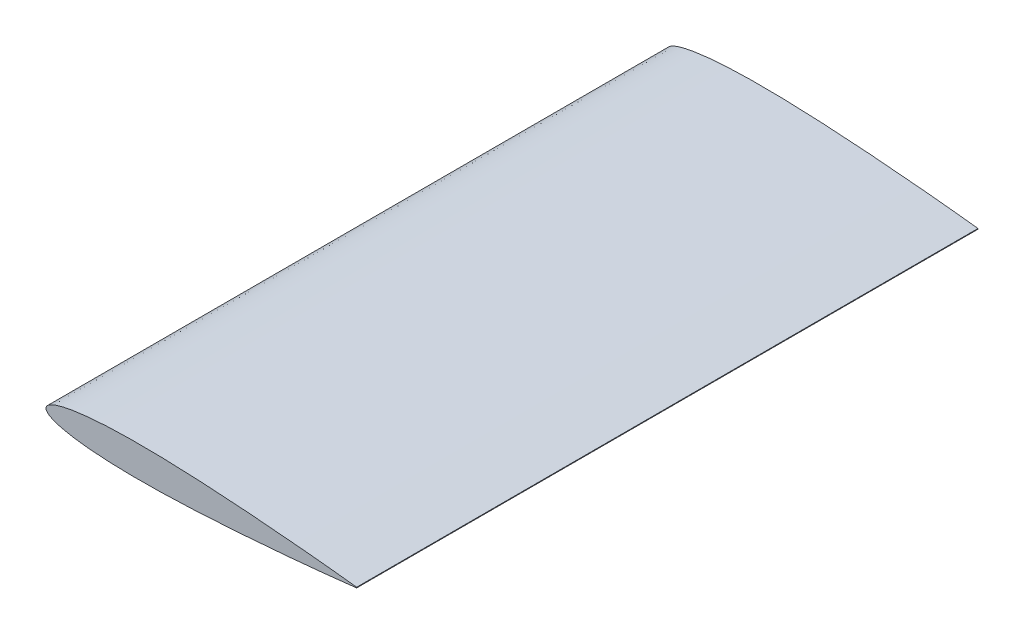
ISO-10303-21;
HEADER;
FILE_DESCRIPTION(('STEP AP214'),'2;1');
FILE_NAME('part.step','',(''),(''),'','','');
FILE_SCHEMA(('AUTOMOTIVE_DESIGN { 1 0 10303 214 1 1 1 1 }'));
ENDSEC;
DATA;
#1=APPLICATION_CONTEXT('core data for automotive mechanical design processes');
#2=APPLICATION_PROTOCOL_DEFINITION('international standard','automotive_design',2000,#1);
#3=PRODUCT_CONTEXT('',#1,'mechanical');
#4=PRODUCT('Part','Part','',(#3));
#5=PRODUCT_RELATED_PRODUCT_CATEGORY('part','',(#4));
#6=PRODUCT_DEFINITION_FORMATION('','',#4);
#7=PRODUCT_DEFINITION_CONTEXT('part definition',#1,'design');
#8=PRODUCT_DEFINITION('design','',#6,#7);
#9=PRODUCT_DEFINITION_SHAPE('','',#8);
#10=(LENGTH_UNIT() NAMED_UNIT(*) SI_UNIT(.MILLI.,.METRE.));
#11=(NAMED_UNIT(*) PLANE_ANGLE_UNIT() SI_UNIT($,.RADIAN.));
#12=(NAMED_UNIT(*) SI_UNIT($,.STERADIAN.) SOLID_ANGLE_UNIT());
#13=UNCERTAINTY_MEASURE_WITH_UNIT(LENGTH_MEASURE(1.E-05),#10,'distance_accuracy_value','');
#14=(GEOMETRIC_REPRESENTATION_CONTEXT(3) GLOBAL_UNCERTAINTY_ASSIGNED_CONTEXT((#13)) GLOBAL_UNIT_ASSIGNED_CONTEXT((#10,
#11,#12)) REPRESENTATION_CONTEXT('',''));
#15=CARTESIAN_POINT('',(0.,0.,0.));
#16=DIRECTION('',(0.,0.,1.));
#17=DIRECTION('',(1.,0.,0.));
#18=AXIS2_PLACEMENT_3D('',#15,#16,#17);
#19=CARTESIAN_POINT('',(40.1321242567515,0.0535132591243339,76.2));
#20=CARTESIAN_POINT('',(40.1279418105788,0.0540050721144117,76.2));
#21=CARTESIAN_POINT('',(40.1112306810011,0.0559701304238156,76.2));
#22=CARTESIAN_POINT('',(40.0736500018208,0.0603077694182548,76.2));
#23=CARTESIAN_POINT('',(40.0110703708323,0.0676571969514773,76.2));
#24=CARTESIAN_POINT('',(39.9235418389783,0.0778500160790829,76.2));
#25=CARTESIAN_POINT('',(39.8111541599803,0.0908957827580396,76.2));
#26=CARTESIAN_POINT('',(39.6740134947025,0.106800014944156,76.2));
#27=CARTESIAN_POINT('',(39.5122696334025,0.125489705283019,76.2));
#28=CARTESIAN_POINT('',(39.326052008163,0.146861496618066,76.2));
#29=CARTESIAN_POINT('',(39.1155709032029,0.170925875928625,76.2));
#30=CARTESIAN_POINT('',(38.8810179946178,0.197663416361273,76.2));
#31=CARTESIAN_POINT('',(38.6226275821043,0.226832706619644,76.2));
#32=CARTESIAN_POINT('',(38.3406749949409,0.258537197320393,76.2));
#33=CARTESIAN_POINT('',(38.0354368307757,0.292609945815936,76.2));
#34=CARTESIAN_POINT('',(37.7071840307129,0.328965573786818,76.2));
#35=CARTESIAN_POINT('',(37.3562624930981,0.367568214027175,76.2));
#36=CARTESIAN_POINT('',(36.9830035756714,0.408250517254515,76.2));
#37=CARTESIAN_POINT('',(36.587790786723,0.450870894472311,76.2));
#38=CARTESIAN_POINT('',(36.1710239241677,0.495565525508571,76.2));
#39=CARTESIAN_POINT('',(35.7330703446121,0.541884830508245,76.2));
#40=CARTESIAN_POINT('',(35.2744157429119,0.5899763151425,76.2));
#41=CARTESIAN_POINT('',(34.7954986183052,0.639725376074922,76.2));
#42=CARTESIAN_POINT('',(34.2967751994489,0.690839822605708,76.2));
#43=CARTESIAN_POINT('',(33.7787145508828,0.743330728829342,76.2));
#44=CARTESIAN_POINT('',(33.2418710797798,0.797207444460088,76.2));
#45=CARTESIAN_POINT('',(32.6867547460175,0.852047913760495,76.2));
#46=CARTESIAN_POINT('',(32.1139436448372,0.908065938360405,76.2));
#47=CARTESIAN_POINT('',(31.5239610615497,0.964829907969942,76.2));
#48=CARTESIAN_POINT('',(30.9174205414204,1.02258034996911,76.2));
#49=CARTESIAN_POINT('',(30.2948930377771,1.08082656422309,76.2));
#50=CARTESIAN_POINT('',(29.6570219518069,1.13977524035605,76.2));
#51=CARTESIAN_POINT('',(29.004390809288,1.19906129287884,76.2));
#52=CARTESIAN_POINT('',(28.3376945314625,1.25874030326226,76.2));
#53=CARTESIAN_POINT('',(27.6575702384295,1.31862610858959,76.2));
#54=CARTESIAN_POINT('',(26.9646919851027,1.37854457465211,76.2));
#55=CARTESIAN_POINT('',(26.2597400034809,1.43840919419539,76.2));
#56=CARTESIAN_POINT('',(25.5434124542922,1.49814917729009,76.2));
#57=CARTESIAN_POINT('',(24.8164129624148,1.55755498997334,76.2));
#58=CARTESIAN_POINT('',(24.0794595530179,1.61657403866187,76.2));
#59=CARTESIAN_POINT('',(23.3332777452138,1.67504069757509,76.2));
#60=CARTESIAN_POINT('',(22.5786257333917,1.73276874566306,76.2));
#61=CARTESIAN_POINT('',(21.8162218953056,1.78971692888558,76.2));
#62=CARTESIAN_POINT('',(21.046840240567,1.84568618796407,76.2));
#63=CARTESIAN_POINT('',(20.2712084549513,1.90053260368886,76.2));
#64=CARTESIAN_POINT('',(19.4901089900151,1.95417086234081,76.2));
#65=CARTESIAN_POINT('',(18.7043206182456,2.00645040641639,76.2));
#66=CARTESIAN_POINT('',(17.9146000739347,2.05713873486335,76.2));
#67=CARTESIAN_POINT('',(17.1217459164428,2.1061363071151,76.2));
#68=CARTESIAN_POINT('',(16.3265273676357,2.15341725133557,76.2));
#69=CARTESIAN_POINT('',(15.5297440018734,2.19860638147546,76.2));
#70=CARTESIAN_POINT('',(14.7321842807355,2.24169620537655,76.2));
#71=CARTESIAN_POINT('',(13.9346236148725,2.28249179202487,76.2));
#72=CARTESIAN_POINT('',(13.1378418921401,2.32086093551415,76.2));
#73=CARTESIAN_POINT('',(12.3426155447534,2.3566094256444,76.2));
#74=CARTESIAN_POINT('',(11.5497643761831,2.38974081095151,76.2));
#75=CARTESIAN_POINT('',(10.7600377543389,2.41981778532476,76.2));
#76=CARTESIAN_POINT('',(9.97424744165448,2.44708366581708,76.2));
#77=CARTESIAN_POINT('',(9.19313934567928,2.47097534206958,76.2));
#78=CARTESIAN_POINT('',(8.41750418608583,2.49169597173862,76.2));
#79=CARTESIAN_POINT('',(7.64811567965739,2.50898985337273,76.2));
#80=CARTESIAN_POINT('',(6.88570301655792,2.52275829295624,76.2));
#81=CARTESIAN_POINT('',(6.13104339467506,2.53275444423582,76.2));
#82=CARTESIAN_POINT('',(5.38485105204477,2.53913164680119,76.2));
#83=CARTESIAN_POINT('',(4.64788512553625,2.54153799464248,76.2));
#84=CARTESIAN_POINT('',(3.92087514141403,2.54000731250512,76.2));
#85=CARTESIAN_POINT('',(3.20453219589683,2.53445020872994,76.2));
#86=CARTESIAN_POINT('',(2.49956553103827,2.52488481958942,76.2));
#87=CARTESIAN_POINT('',(1.80667307590379,2.51103486604574,76.2));
#88=CARTESIAN_POINT('',(1.12652852955934,2.49306760487807,76.2));
#89=CARTESIAN_POINT('',(0.459809878985288,2.47088592607632,76.2));
#90=CARTESIAN_POINT('',(-0.192838445901487,2.44443382966969,76.2));
#91=CARTESIAN_POINT('',(-0.830738428269239,2.41370818746878,76.2));
#92=CARTESIAN_POINT('',(-1.45328379873764,2.37878688734276,76.2));
#93=CARTESIAN_POINT('',(-2.05986417382781,2.33965635630447,76.2));
#94=CARTESIAN_POINT('',(-2.64986914419755,2.29631645942534,76.2));
#95=CARTESIAN_POINT('',(-3.22271949769868,2.24878538817981,76.2));
#96=CARTESIAN_POINT('',(-3.77786955569188,2.19725198261085,76.2));
#97=CARTESIAN_POINT('',(-4.3147597071102,2.14160909006856,76.2));
#98=CARTESIAN_POINT('',(-4.83286615753457,2.08209956747325,76.2));
#99=CARTESIAN_POINT('',(-5.33163777717199,2.0187267292494,76.2));
#100=CARTESIAN_POINT('',(-5.81062084975922,1.95160118572107,76.2));
#101=CARTESIAN_POINT('',(-6.26933866851263,1.88082151875277,76.2));
#102=CARTESIAN_POINT('',(-6.70736929256317,1.80658674829826,76.2));
#103=CARTESIAN_POINT('',(-7.12423437792924,1.72887793709155,76.2));
#104=CARTESIAN_POINT('',(-7.51954065509877,1.64788477248388,76.2));
#105=CARTESIAN_POINT('',(-7.89292670509431,1.56377392761245,76.2));
#106=CARTESIAN_POINT('',(-8.24400123777592,1.47664693629061,76.2));
#107=CARTESIAN_POINT('',(-8.57242018282951,1.38660576756098,76.2));
#108=CARTESIAN_POINT('',(-8.87788299174352,1.29389098278241,76.2));
#109=CARTESIAN_POINT('',(-9.16011072254911,1.19854663873041,76.2));
#110=CARTESIAN_POINT('',(-9.41882434926777,1.10068145098127,76.2));
#111=CARTESIAN_POINT('',(-9.65381471632782,1.000471331635,76.2));
#112=CARTESIAN_POINT('',(-9.86484204596546,0.897997360188644,76.2));
#113=CARTESIAN_POINT('',(-10.0517333555882,0.793330779378764,76.2));
#114=CARTESIAN_POINT('',(-10.2144396307485,0.686687292838309,76.2));
#115=CARTESIAN_POINT('',(-10.3527397509045,0.577857279629728,76.2));
#116=CARTESIAN_POINT('',(-10.4665950669418,0.466915986358584,76.2));
#117=CARTESIAN_POINT('',(-10.5558891163278,0.35374488731564,76.2));
#118=CARTESIAN_POINT('',(-10.6202773458401,0.238098542259817,76.2));
#119=CARTESIAN_POINT('',(-10.6592143401123,0.119945635455643,76.2));
#120=CARTESIAN_POINT('',(-10.6721398921472,0.000173259124337126,76.2));
#121=CARTESIAN_POINT('',(-10.6592143401123,-0.119599117206975,76.2));
#122=CARTESIAN_POINT('',(-10.6202773458401,-0.237752024011159,76.2));
#123=CARTESIAN_POINT('',(-10.5558891163278,-0.353398369066962,76.2));
#124=CARTESIAN_POINT('',(-10.4665950669418,-0.466569468109921,76.2));
#125=CARTESIAN_POINT('',(-10.3527397509045,-0.57751076138106,76.2));
#126=CARTESIAN_POINT('',(-10.2144396307485,-0.686340774589639,76.2));
#127=CARTESIAN_POINT('',(-10.0517333555882,-0.792984261130103,76.2));
#128=CARTESIAN_POINT('',(-9.86484204596547,-0.89765084193997,76.2));
#129=CARTESIAN_POINT('',(-9.65381471632782,-1.00012481338633,76.2));
#130=CARTESIAN_POINT('',(-9.41882434926777,-1.1003349327326,76.2));
#131=CARTESIAN_POINT('',(-9.16011072254912,-1.19820012048174,76.2));
#132=CARTESIAN_POINT('',(-8.87788299174351,-1.29354446453374,76.2));
#133=CARTESIAN_POINT('',(-8.57242018282952,-1.38625924931231,76.2));
#134=CARTESIAN_POINT('',(-8.24400123777591,-1.47630041804194,76.2));
#135=CARTESIAN_POINT('',(-7.89292670509432,-1.56342740936378,76.2));
#136=CARTESIAN_POINT('',(-7.51954065509876,-1.64753825423521,76.2));
#137=CARTESIAN_POINT('',(-7.12423437792925,-1.72853141884288,76.2));
#138=CARTESIAN_POINT('',(-6.70736929256316,-1.80624023004959,76.2));
#139=CARTESIAN_POINT('',(-6.26933866851263,-1.8804750005041,76.2));
#140=CARTESIAN_POINT('',(-5.81062084975922,-1.9512546674724,76.2));
#141=CARTESIAN_POINT('',(-5.33163777717199,-2.01838021100073,76.2));
#142=CARTESIAN_POINT('',(-4.83286615753458,-2.08175304922458,76.2));
#143=CARTESIAN_POINT('',(-4.31475970711019,-2.14126257181989,76.2));
#144=CARTESIAN_POINT('',(-3.77786955569188,-2.19690546436219,76.2));
#145=CARTESIAN_POINT('',(-3.22271949769869,-2.24843886993114,76.2));
#146=CARTESIAN_POINT('',(-2.64986914419754,-2.29596994117668,76.2));
#147=CARTESIAN_POINT('',(-2.05986417382782,-2.3393098380558,76.2));
#148=CARTESIAN_POINT('',(-1.45328379873763,-2.37844036909409,76.2));
#149=CARTESIAN_POINT('',(-0.830738428269235,-2.41336166922011,76.2));
#150=CARTESIAN_POINT('',(-0.192838445901483,-2.44408731142102,76.2));
#151=CARTESIAN_POINT('',(0.459809878985286,-2.47053940782765,76.2));
#152=CARTESIAN_POINT('',(1.12652852955934,-2.4927210866294,76.2));
#153=CARTESIAN_POINT('',(1.80667307590379,-2.51068834779707,76.2));
#154=CARTESIAN_POINT('',(2.49956553103827,-2.52453830134076,76.2));
#155=CARTESIAN_POINT('',(3.20453219589683,-2.53410369048127,76.2));
#156=CARTESIAN_POINT('',(3.92087514141403,-2.53966079425645,76.2));
#157=CARTESIAN_POINT('',(4.64788512553625,-2.54119147639381,76.2));
#158=CARTESIAN_POINT('',(5.38485105204477,-2.53878512855252,76.2));
#159=CARTESIAN_POINT('',(6.13104339467506,-2.53240792598715,76.2));
#160=CARTESIAN_POINT('',(6.88570301655792,-2.52241177470757,76.2));
#161=CARTESIAN_POINT('',(7.6481156796574,-2.50864333512407,76.2));
#162=CARTESIAN_POINT('',(8.41750418608584,-2.49134945348995,76.2));
#163=CARTESIAN_POINT('',(9.19313934567927,-2.47062882382092,76.2));
#164=CARTESIAN_POINT('',(9.97424744165448,-2.44673714756841,76.2));
#165=CARTESIAN_POINT('',(10.7600377543389,-2.41947126707609,76.2));
#166=CARTESIAN_POINT('',(11.5497643761831,-2.38939429270284,76.2));
#167=CARTESIAN_POINT('',(12.3426155447534,-2.35626290739573,76.2));
#168=CARTESIAN_POINT('',(13.1378418921401,-2.32051441726548,76.2));
#169=CARTESIAN_POINT('',(13.9346236148725,-2.2821452737762,76.2));
#170=CARTESIAN_POINT('',(14.7321842807355,-2.24134968712788,76.2));
#171=CARTESIAN_POINT('',(15.5297440018734,-2.19825986322679,76.2));
#172=CARTESIAN_POINT('',(16.3265273676357,-2.1530707330869,76.2));
#173=CARTESIAN_POINT('',(17.1217459164429,-2.10578978886643,76.2));
#174=CARTESIAN_POINT('',(17.9146000739347,-2.05679221661469,76.2));
#175=CARTESIAN_POINT('',(18.7043206182456,-2.00610388816772,76.2));
#176=CARTESIAN_POINT('',(19.4901089900151,-1.95382434409214,76.2));
#177=CARTESIAN_POINT('',(20.2712084549513,-1.9001860854402,76.2));
#178=CARTESIAN_POINT('',(21.046840240567,-1.8453396697154,76.2));
#179=CARTESIAN_POINT('',(21.8162218953056,-1.78937041063691,76.2));
#180=CARTESIAN_POINT('',(22.5786257333917,-1.73242222741439,76.2));
#181=CARTESIAN_POINT('',(23.3332777452138,-1.67469417932642,76.2));
#182=CARTESIAN_POINT('',(24.0794595530179,-1.61622752041321,76.2));
#183=CARTESIAN_POINT('',(24.8164129624148,-1.55720847172467,76.2));
#184=CARTESIAN_POINT('',(25.5434124542922,-1.49780265904142,76.2));
#185=CARTESIAN_POINT('',(26.2597400034809,-1.43806267594672,76.2));
#186=CARTESIAN_POINT('',(26.9646919851027,-1.37819805640344,76.2));
#187=CARTESIAN_POINT('',(27.6575702384295,-1.31827959034092,76.2));
#188=CARTESIAN_POINT('',(28.3376945314625,-1.25839378501359,76.2));
#189=CARTESIAN_POINT('',(29.004390809288,-1.19871477463017,76.2));
#190=CARTESIAN_POINT('',(29.6570219518069,-1.13942872210738,76.2));
#191=CARTESIAN_POINT('',(30.2948930377771,-1.08048004597442,76.2));
#192=CARTESIAN_POINT('',(30.9174205414204,-1.02223383172044,76.2));
#193=CARTESIAN_POINT('',(31.5239610615497,-0.964483389721274,76.2));
#194=CARTESIAN_POINT('',(32.1139436448372,-0.907719420111737,76.2));
#195=CARTESIAN_POINT('',(32.6867547460175,-0.851701395511828,76.2));
#196=CARTESIAN_POINT('',(33.2418710797798,-0.79686092621142,76.2));
#197=CARTESIAN_POINT('',(33.7787145508828,-0.742984210580674,76.2));
#198=CARTESIAN_POINT('',(34.296775199449,-0.690493304357041,76.2));
#199=CARTESIAN_POINT('',(34.7954986183052,-0.639378857826254,76.2));
#200=CARTESIAN_POINT('',(35.2744157429119,-0.589629796893832,76.2));
#201=CARTESIAN_POINT('',(35.7330703446121,-0.541538312259577,76.2));
#202=CARTESIAN_POINT('',(36.1710239241677,-0.495219007259902,76.2));
#203=CARTESIAN_POINT('',(36.587790786723,-0.450524376223643,76.2));
#204=CARTESIAN_POINT('',(36.9830035756714,-0.407903999005847,76.2));
#205=CARTESIAN_POINT('',(37.3562624930981,-0.367221695778506,76.2));
#206=CARTESIAN_POINT('',(37.7071840307129,-0.328619055538152,76.2));
#207=CARTESIAN_POINT('',(38.0354368307757,-0.292263427567267,76.2));
#208=CARTESIAN_POINT('',(38.3406749949409,-0.258190679071726,76.2));
#209=CARTESIAN_POINT('',(38.6226275821043,-0.226486188370977,76.2));
#210=CARTESIAN_POINT('',(38.8810179946178,-0.197316898112605,76.2));
#211=CARTESIAN_POINT('',(39.1155709032029,-0.170579357679958,76.2));
#212=CARTESIAN_POINT('',(39.326052008163,-0.146514978369398,76.2));
#213=CARTESIAN_POINT('',(39.5122696334024,-0.12514318703435,76.2));
#214=CARTESIAN_POINT('',(39.6740134947025,-0.106453496695489,76.2));
#215=CARTESIAN_POINT('',(39.8111541599803,-0.0905492645093712,76.2));
#216=CARTESIAN_POINT('',(39.9235418389783,-0.0775034978304145,76.2));
#217=CARTESIAN_POINT('',(40.0110703708323,-0.0673106787028109,76.2));
#218=CARTESIAN_POINT('',(40.0736500018208,-0.0599612511695863,76.2));
#219=CARTESIAN_POINT('',(40.1112306810011,-0.0556236121751492,76.2));
#220=CARTESIAN_POINT('',(40.1279418105788,-0.053658553865744,76.2));
#221=CARTESIAN_POINT('',(40.1321242567515,-0.0531667408756661,76.2));
#222=B_SPLINE_CURVE_WITH_KNOTS('',3,(#19,#20,#21,#22,#23,#24,#25,#26,#27,#28,#29,#30,#31,#32,
#33,#34,#35,#36,#37,#38,#39,#40,#41,#42,#43,#44,#45,#46,#47,#48,#49,#50,#51,#52,#53,#54,#55,#56,
#57,#58,#59,#60,#61,#62,#63,#64,#65,#66,#67,#68,#69,#70,#71,#72,#73,#74,#75,#76,#77,#78,#79,#80,
#81,#82,#83,#84,#85,#86,#87,#88,#89,#90,#91,#92,#93,#94,#95,#96,#97,#98,#99,#100,#101,#102,#103,
#104,#105,#106,#107,#108,#109,#110,#111,#112,#113,#114,#115,#116,#117,#118,#119,#120,#121,#122,
#123,#124,#125,#126,#127,#128,#129,#130,#131,#132,#133,#134,#135,#136,#137,#138,#139,#140,#141,
#142,#143,#144,#145,#146,#147,#148,#149,#150,#151,#152,#153,#154,#155,#156,#157,#158,#159,#160,
#161,#162,#163,#164,#165,#166,#167,#168,#169,#170,#171,#172,#173,#174,#175,#176,#177,#178,#179,
#180,#181,#182,#183,#184,#185,#186,#187,#188,#189,#190,#191,#192,#193,#194,#195,#196,#197,#198,
#199,#200,#201,#202,#203,#204,#205,#206,#207,#208,#209,#210,#211,#212,#213,#214,#215,#216,#217,
#218,#219,#220,#221),.UNSPECIFIED.,.F.,.F.,(4,1,1,1,1,1,1,1,1,1,1,1,1,1,1,1,1,1,1,1,1,1,1,1,1,1,
1,1,1,1,1,1,1,1,1,1,1,1,1,1,1,1,1,1,1,1,1,1,1,1,1,1,1,1,1,1,1,1,1,1,1,1,1,1,1,1,1,1,1,1,1,1,1,1,
1,1,1,1,1,1,1,1,1,1,1,1,1,1,1,1,1,1,1,1,1,1,1,1,1,1,1,1,1,1,1,1,1,1,1,1,1,1,1,1,1,1,1,1,1,1,1,1,
1,1,1,1,1,1,1,1,1,1,1,1,1,1,1,1,1,1,1,1,1,1,1,1,1,1,1,1,1,1,1,1,1,1,1,1,1,1,1,1,1,1,1,1,1,1,1,1,
1,1,1,1,1,1,1,1,1,1,1,1,1,1,1,1,1,1,1,1,1,1,1,1,1,1,1,1,1,1,4),(0.,0.000122570507308786,
0.00048973532365806,0.00110106200402247,0.00195649344729355,0.0030545041094015,
0.00439411498243635,0.00597477989813809,0.00779344868462634,0.00984963228517402,
0.0121408268653583,0.0146644178506701,0.0174179579231429,0.020398889469767,0.0236036763688049,
0.0270303070800951,0.0306742136802222,0.0345318633958163,0.0385998295036856,0.0428739336994172,
0.0473497702771596,0.0520223394036802,0.056888012236143,0.0619413525769067,0.0671779040423508,
0.072591544051771,0.0781768862612534,0.0839293335185458,0.0898425177635944,0.0959103284590374,
0.102127379220862,0.108487120588097,0.114983630725241,0.121609427488233,0.12835899555107,
0.135225391766802,0.142201182825331,0.149280369782236,0.156455523184093,0.163719176198334,
0.171064848640563,0.178484135596058,0.185971055321065,0.193517173214291,0.201115568071228,
0.208758796643717,0.216438406103102,0.22414798129968,0.23187914276341,0.239624414332632,
0.247375923198132,0.255126267915569,0.262868056408785,0.270593414492002,0.278294991932661,
0.285964404290064,0.293595346075518,0.301179449231067,0.308709443267105,0.316178517142686,
0.323578401269838,0.330903311741252,0.33814503752322,0.345297336807964,0.352353016219242,
0.359304898803913,0.366147304895831,0.372873117461533,0.379475704068392,0.385949951970654,
0.392288810204805,0.39848671896189,0.404537629244294,0.410436531608853,0.416177965587354,
0.421755987337224,0.427166614207208,0.432405016355602,0.4374657805932,0.44234512402414,
0.447038299591253,0.451542591807005,0.455853834586592,0.459968626751863,0.463884025378794,
0.467597723169667,0.471107723265752,0.474411229633955,0.477508152965533,0.480397557703708,
0.483080057446873,0.485556878562922,0.487830503269212,0.489904702577464,0.491787243593992,
0.49348706824616,0.495019104104399,0.496403631059307,0.497668333190465,0.498852082705105,0.5,
0.501147917294895,0.502331666809536,0.503596368940693,0.504980895895602,0.506512931753841,
0.508212756406008,0.510095297422536,0.512169496730788,0.514443121437078,0.516919942553128,
0.519602442296293,0.522491847034467,0.525588770366046,0.528892276734249,0.532402276830334,
0.536115974621206,0.540031373248137,0.544146165413409,0.548457408192995,0.552961700408748,
0.557654875975861,0.5625342194068,0.567594983644398,0.572833385792793,0.578244012662777,
0.583822034412646,0.589563468391148,0.595462370755707,0.60151328103811,0.607711189795196,
0.614050048029347,0.620524295931608,0.627126882538468,0.63385269510417,0.640695101196087,
0.647646983780759,0.654702663192037,0.661854962476781,0.669096688258748,0.676421598730163,
0.683821482857315,0.691290556732896,0.698820550768934,0.706404653924482,0.714035595709937,
0.72170500806734,0.729406585507999,0.737131943591215,0.744873732084432,0.752624076801869,
0.760375585667369,0.76812085723659,0.775852018700321,0.783561593896899,0.791241203356283,
0.798884431928772,0.80648282678571,0.814028944678936,0.821515864403943,0.828935151359437,
0.836280823801666,0.843544476815908,0.850719630217764,0.85779881717467,0.864774608233199,
0.871641004448931,0.878390572511768,0.88501636927476,0.891512879411904,0.897872620779138,
0.904089671540963,0.910157482236406,0.916070666481455,0.921823113738747,0.92740845594823,
0.93282209595765,0.938058647423094,0.943111987763858,0.94797766059632,0.952650229722841,
0.957126066300583,0.961400170496315,0.965468136604184,0.969325786319778,0.972969692919905,
0.976396323631195,0.979601110530233,0.982582042076857,0.98533558214933,0.987859173134642,
0.990150367714826,0.992206551315374,0.994025220101862,0.995605885017564,0.996945495890599,
0.998043506552707,0.998898937995978,0.999510264676342,0.999877429492691,1.),.UNSPECIFIED.);
#223=DIRECTION('',(0.,0.,-1.));
#224=VECTOR('',#223,1.);
#225=SURFACE_OF_LINEAR_EXTRUSION('',#222,#224);
#226=CARTESIAN_POINT('',(40.1321242567515,0.0535132591243339,-25.4));
#227=CARTESIAN_POINT('',(40.1279418105788,0.0540050721144117,-25.4));
#228=CARTESIAN_POINT('',(40.1112306810011,0.0559701304238156,-25.4));
#229=CARTESIAN_POINT('',(40.0736500018208,0.0603077694182548,-25.4));
#230=CARTESIAN_POINT('',(40.0110703708323,0.0676571969514773,-25.4));
#231=CARTESIAN_POINT('',(39.9235418389783,0.0778500160790829,-25.4));
#232=CARTESIAN_POINT('',(39.8111541599803,0.0908957827580396,-25.4));
#233=CARTESIAN_POINT('',(39.6740134947025,0.106800014944156,-25.4));
#234=CARTESIAN_POINT('',(39.5122696334025,0.125489705283019,-25.4));
#235=CARTESIAN_POINT('',(39.326052008163,0.146861496618066,-25.4));
#236=CARTESIAN_POINT('',(39.1155709032029,0.170925875928625,-25.4));
#237=CARTESIAN_POINT('',(38.8810179946178,0.197663416361273,-25.4));
#238=CARTESIAN_POINT('',(38.6226275821043,0.226832706619644,-25.4));
#239=CARTESIAN_POINT('',(38.3406749949409,0.258537197320393,-25.4));
#240=CARTESIAN_POINT('',(38.0354368307757,0.292609945815936,-25.4));
#241=CARTESIAN_POINT('',(37.7071840307129,0.328965573786818,-25.4));
#242=CARTESIAN_POINT('',(37.3562624930981,0.367568214027175,-25.4));
#243=CARTESIAN_POINT('',(36.9830035756714,0.408250517254515,-25.4));
#244=CARTESIAN_POINT('',(36.587790786723,0.450870894472311,-25.4));
#245=CARTESIAN_POINT('',(36.1710239241677,0.495565525508571,-25.4));
#246=CARTESIAN_POINT('',(35.7330703446121,0.541884830508245,-25.4));
#247=CARTESIAN_POINT('',(35.2744157429119,0.5899763151425,-25.4));
#248=CARTESIAN_POINT('',(34.7954986183052,0.639725376074922,-25.4));
#249=CARTESIAN_POINT('',(34.2967751994489,0.690839822605708,-25.4));
#250=CARTESIAN_POINT('',(33.7787145508828,0.743330728829342,-25.4));
#251=CARTESIAN_POINT('',(33.2418710797798,0.797207444460088,-25.4));
#252=CARTESIAN_POINT('',(32.6867547460175,0.852047913760495,-25.4));
#253=CARTESIAN_POINT('',(32.1139436448372,0.908065938360405,-25.4));
#254=CARTESIAN_POINT('',(31.5239610615497,0.964829907969942,-25.4));
#255=CARTESIAN_POINT('',(30.9174205414204,1.02258034996911,-25.4));
#256=CARTESIAN_POINT('',(30.2948930377771,1.08082656422309,-25.4));
#257=CARTESIAN_POINT('',(29.6570219518069,1.13977524035605,-25.4));
#258=CARTESIAN_POINT('',(29.004390809288,1.19906129287884,-25.4));
#259=CARTESIAN_POINT('',(28.3376945314625,1.25874030326226,-25.4));
#260=CARTESIAN_POINT('',(27.6575702384295,1.31862610858959,-25.4));
#261=CARTESIAN_POINT('',(26.9646919851027,1.37854457465211,-25.4));
#262=CARTESIAN_POINT('',(26.2597400034809,1.43840919419539,-25.4));
#263=CARTESIAN_POINT('',(25.5434124542922,1.49814917729009,-25.4));
#264=CARTESIAN_POINT('',(24.8164129624148,1.55755498997334,-25.4));
#265=CARTESIAN_POINT('',(24.0794595530179,1.61657403866187,-25.4));
#266=CARTESIAN_POINT('',(23.3332777452138,1.67504069757509,-25.4));
#267=CARTESIAN_POINT('',(22.5786257333917,1.73276874566306,-25.4));
#268=CARTESIAN_POINT('',(21.8162218953056,1.78971692888558,-25.4));
#269=CARTESIAN_POINT('',(21.046840240567,1.84568618796407,-25.4));
#270=CARTESIAN_POINT('',(20.2712084549513,1.90053260368886,-25.4));
#271=CARTESIAN_POINT('',(19.4901089900151,1.95417086234081,-25.4));
#272=CARTESIAN_POINT('',(18.7043206182456,2.00645040641639,-25.4));
#273=CARTESIAN_POINT('',(17.9146000739347,2.05713873486335,-25.4));
#274=CARTESIAN_POINT('',(17.1217459164428,2.1061363071151,-25.4));
#275=CARTESIAN_POINT('',(16.3265273676357,2.15341725133557,-25.4));
#276=CARTESIAN_POINT('',(15.5297440018734,2.19860638147546,-25.4));
#277=CARTESIAN_POINT('',(14.7321842807355,2.24169620537655,-25.4));
#278=CARTESIAN_POINT('',(13.9346236148725,2.28249179202487,-25.4));
#279=CARTESIAN_POINT('',(13.1378418921401,2.32086093551415,-25.4));
#280=CARTESIAN_POINT('',(12.3426155447534,2.3566094256444,-25.4));
#281=CARTESIAN_POINT('',(11.5497643761831,2.38974081095151,-25.4));
#282=CARTESIAN_POINT('',(10.7600377543389,2.41981778532476,-25.4));
#283=CARTESIAN_POINT('',(9.97424744165448,2.44708366581708,-25.4));
#284=CARTESIAN_POINT('',(9.19313934567928,2.47097534206958,-25.4));
#285=CARTESIAN_POINT('',(8.41750418608583,2.49169597173862,-25.4));
#286=CARTESIAN_POINT('',(7.64811567965739,2.50898985337273,-25.4));
#287=CARTESIAN_POINT('',(6.88570301655792,2.52275829295624,-25.4));
#288=CARTESIAN_POINT('',(6.13104339467506,2.53275444423582,-25.4));
#289=CARTESIAN_POINT('',(5.38485105204477,2.53913164680119,-25.4));
#290=CARTESIAN_POINT('',(4.64788512553625,2.54153799464248,-25.4));
#291=CARTESIAN_POINT('',(3.92087514141403,2.54000731250512,-25.4));
#292=CARTESIAN_POINT('',(3.20453219589683,2.53445020872994,-25.4));
#293=CARTESIAN_POINT('',(2.49956553103827,2.52488481958942,-25.4));
#294=CARTESIAN_POINT('',(1.80667307590379,2.51103486604574,-25.4));
#295=CARTESIAN_POINT('',(1.12652852955934,2.49306760487807,-25.4));
#296=CARTESIAN_POINT('',(0.459809878985288,2.47088592607632,-25.4));
#297=CARTESIAN_POINT('',(-0.192838445901487,2.44443382966969,-25.4));
#298=CARTESIAN_POINT('',(-0.830738428269239,2.41370818746878,-25.4));
#299=CARTESIAN_POINT('',(-1.45328379873764,2.37878688734276,-25.4));
#300=CARTESIAN_POINT('',(-2.05986417382781,2.33965635630447,-25.4));
#301=CARTESIAN_POINT('',(-2.64986914419755,2.29631645942534,-25.4));
#302=CARTESIAN_POINT('',(-3.22271949769868,2.24878538817981,-25.4));
#303=CARTESIAN_POINT('',(-3.77786955569188,2.19725198261085,-25.4));
#304=CARTESIAN_POINT('',(-4.3147597071102,2.14160909006856,-25.4));
#305=CARTESIAN_POINT('',(-4.83286615753457,2.08209956747325,-25.4));
#306=CARTESIAN_POINT('',(-5.33163777717199,2.0187267292494,-25.4));
#307=CARTESIAN_POINT('',(-5.81062084975922,1.95160118572107,-25.4));
#308=CARTESIAN_POINT('',(-6.26933866851263,1.88082151875277,-25.4));
#309=CARTESIAN_POINT('',(-6.70736929256317,1.80658674829826,-25.4));
#310=CARTESIAN_POINT('',(-7.12423437792924,1.72887793709155,-25.4));
#311=CARTESIAN_POINT('',(-7.51954065509877,1.64788477248388,-25.4));
#312=CARTESIAN_POINT('',(-7.89292670509431,1.56377392761245,-25.4));
#313=CARTESIAN_POINT('',(-8.24400123777592,1.47664693629061,-25.4));
#314=CARTESIAN_POINT('',(-8.57242018282951,1.38660576756098,-25.4));
#315=CARTESIAN_POINT('',(-8.87788299174352,1.29389098278241,-25.4));
#316=CARTESIAN_POINT('',(-9.16011072254911,1.19854663873041,-25.4));
#317=CARTESIAN_POINT('',(-9.41882434926777,1.10068145098127,-25.4));
#318=CARTESIAN_POINT('',(-9.65381471632782,1.000471331635,-25.4));
#319=CARTESIAN_POINT('',(-9.86484204596546,0.897997360188644,-25.4));
#320=CARTESIAN_POINT('',(-10.0517333555882,0.793330779378764,-25.4));
#321=CARTESIAN_POINT('',(-10.2144396307485,0.686687292838309,-25.4));
#322=CARTESIAN_POINT('',(-10.3527397509045,0.577857279629728,-25.4));
#323=CARTESIAN_POINT('',(-10.4665950669418,0.466915986358584,-25.4));
#324=CARTESIAN_POINT('',(-10.5558891163278,0.35374488731564,-25.4));
#325=CARTESIAN_POINT('',(-10.6202773458401,0.238098542259817,-25.4));
#326=CARTESIAN_POINT('',(-10.6592143401123,0.119945635455643,-25.4));
#327=CARTESIAN_POINT('',(-10.6721398921472,0.000173259124337126,-25.4));
#328=CARTESIAN_POINT('',(-10.6592143401123,-0.119599117206975,-25.4));
#329=CARTESIAN_POINT('',(-10.6202773458401,-0.237752024011159,-25.4));
#330=CARTESIAN_POINT('',(-10.5558891163278,-0.353398369066962,-25.4));
#331=CARTESIAN_POINT('',(-10.4665950669418,-0.466569468109921,-25.4));
#332=CARTESIAN_POINT('',(-10.3527397509045,-0.57751076138106,-25.4));
#333=CARTESIAN_POINT('',(-10.2144396307485,-0.686340774589639,-25.4));
#334=CARTESIAN_POINT('',(-10.0517333555882,-0.792984261130103,-25.4));
#335=CARTESIAN_POINT('',(-9.86484204596547,-0.89765084193997,-25.4));
#336=CARTESIAN_POINT('',(-9.65381471632782,-1.00012481338633,-25.4));
#337=CARTESIAN_POINT('',(-9.41882434926777,-1.1003349327326,-25.4));
#338=CARTESIAN_POINT('',(-9.16011072254912,-1.19820012048174,-25.4));
#339=CARTESIAN_POINT('',(-8.87788299174351,-1.29354446453374,-25.4));
#340=CARTESIAN_POINT('',(-8.57242018282952,-1.38625924931231,-25.4));
#341=CARTESIAN_POINT('',(-8.24400123777591,-1.47630041804194,-25.4));
#342=CARTESIAN_POINT('',(-7.89292670509432,-1.56342740936378,-25.4));
#343=CARTESIAN_POINT('',(-7.51954065509876,-1.64753825423521,-25.4));
#344=CARTESIAN_POINT('',(-7.12423437792925,-1.72853141884288,-25.4));
#345=CARTESIAN_POINT('',(-6.70736929256316,-1.80624023004959,-25.4));
#346=CARTESIAN_POINT('',(-6.26933866851263,-1.8804750005041,-25.4));
#347=CARTESIAN_POINT('',(-5.81062084975922,-1.9512546674724,-25.4));
#348=CARTESIAN_POINT('',(-5.33163777717199,-2.01838021100073,-25.4));
#349=CARTESIAN_POINT('',(-4.83286615753458,-2.08175304922458,-25.4));
#350=CARTESIAN_POINT('',(-4.31475970711019,-2.14126257181989,-25.4));
#351=CARTESIAN_POINT('',(-3.77786955569188,-2.19690546436219,-25.4));
#352=CARTESIAN_POINT('',(-3.22271949769869,-2.24843886993114,-25.4));
#353=CARTESIAN_POINT('',(-2.64986914419754,-2.29596994117668,-25.4));
#354=CARTESIAN_POINT('',(-2.05986417382782,-2.3393098380558,-25.4));
#355=CARTESIAN_POINT('',(-1.45328379873763,-2.37844036909409,-25.4));
#356=CARTESIAN_POINT('',(-0.830738428269235,-2.41336166922011,-25.4));
#357=CARTESIAN_POINT('',(-0.192838445901483,-2.44408731142102,-25.4));
#358=CARTESIAN_POINT('',(0.459809878985286,-2.47053940782765,-25.4));
#359=CARTESIAN_POINT('',(1.12652852955934,-2.4927210866294,-25.4));
#360=CARTESIAN_POINT('',(1.80667307590379,-2.51068834779707,-25.4));
#361=CARTESIAN_POINT('',(2.49956553103827,-2.52453830134076,-25.4));
#362=CARTESIAN_POINT('',(3.20453219589683,-2.53410369048127,-25.4));
#363=CARTESIAN_POINT('',(3.92087514141403,-2.53966079425645,-25.4));
#364=CARTESIAN_POINT('',(4.64788512553625,-2.54119147639381,-25.4));
#365=CARTESIAN_POINT('',(5.38485105204477,-2.53878512855252,-25.4));
#366=CARTESIAN_POINT('',(6.13104339467506,-2.53240792598715,-25.4));
#367=CARTESIAN_POINT('',(6.88570301655792,-2.52241177470757,-25.4));
#368=CARTESIAN_POINT('',(7.6481156796574,-2.50864333512407,-25.4));
#369=CARTESIAN_POINT('',(8.41750418608584,-2.49134945348995,-25.4));
#370=CARTESIAN_POINT('',(9.19313934567927,-2.47062882382092,-25.4));
#371=CARTESIAN_POINT('',(9.97424744165448,-2.44673714756841,-25.4));
#372=CARTESIAN_POINT('',(10.7600377543389,-2.41947126707609,-25.4));
#373=CARTESIAN_POINT('',(11.5497643761831,-2.38939429270284,-25.4));
#374=CARTESIAN_POINT('',(12.3426155447534,-2.35626290739573,-25.4));
#375=CARTESIAN_POINT('',(13.1378418921401,-2.32051441726548,-25.4));
#376=CARTESIAN_POINT('',(13.9346236148725,-2.2821452737762,-25.4));
#377=CARTESIAN_POINT('',(14.7321842807355,-2.24134968712788,-25.4));
#378=CARTESIAN_POINT('',(15.5297440018734,-2.19825986322679,-25.4));
#379=CARTESIAN_POINT('',(16.3265273676357,-2.1530707330869,-25.4));
#380=CARTESIAN_POINT('',(17.1217459164429,-2.10578978886643,-25.4));
#381=CARTESIAN_POINT('',(17.9146000739347,-2.05679221661469,-25.4));
#382=CARTESIAN_POINT('',(18.7043206182456,-2.00610388816772,-25.4));
#383=CARTESIAN_POINT('',(19.4901089900151,-1.95382434409214,-25.4));
#384=CARTESIAN_POINT('',(20.2712084549513,-1.9001860854402,-25.4));
#385=CARTESIAN_POINT('',(21.046840240567,-1.8453396697154,-25.4));
#386=CARTESIAN_POINT('',(21.8162218953056,-1.78937041063691,-25.4));
#387=CARTESIAN_POINT('',(22.5786257333917,-1.73242222741439,-25.4));
#388=CARTESIAN_POINT('',(23.3332777452138,-1.67469417932642,-25.4));
#389=CARTESIAN_POINT('',(24.0794595530179,-1.61622752041321,-25.4));
#390=CARTESIAN_POINT('',(24.8164129624148,-1.55720847172467,-25.4));
#391=CARTESIAN_POINT('',(25.5434124542922,-1.49780265904142,-25.4));
#392=CARTESIAN_POINT('',(26.2597400034809,-1.43806267594672,-25.4));
#393=CARTESIAN_POINT('',(26.9646919851027,-1.37819805640344,-25.4));
#394=CARTESIAN_POINT('',(27.6575702384295,-1.31827959034092,-25.4));
#395=CARTESIAN_POINT('',(28.3376945314625,-1.25839378501359,-25.4));
#396=CARTESIAN_POINT('',(29.004390809288,-1.19871477463017,-25.4));
#397=CARTESIAN_POINT('',(29.6570219518069,-1.13942872210738,-25.4));
#398=CARTESIAN_POINT('',(30.2948930377771,-1.08048004597442,-25.4));
#399=CARTESIAN_POINT('',(30.9174205414204,-1.02223383172044,-25.4));
#400=CARTESIAN_POINT('',(31.5239610615497,-0.964483389721274,-25.4));
#401=CARTESIAN_POINT('',(32.1139436448372,-0.907719420111737,-25.4));
#402=CARTESIAN_POINT('',(32.6867547460175,-0.851701395511828,-25.4));
#403=CARTESIAN_POINT('',(33.2418710797798,-0.79686092621142,-25.4));
#404=CARTESIAN_POINT('',(33.7787145508828,-0.742984210580674,-25.4));
#405=CARTESIAN_POINT('',(34.296775199449,-0.690493304357041,-25.4));
#406=CARTESIAN_POINT('',(34.7954986183052,-0.639378857826254,-25.4));
#407=CARTESIAN_POINT('',(35.2744157429119,-0.589629796893832,-25.4));
#408=CARTESIAN_POINT('',(35.7330703446121,-0.541538312259577,-25.4));
#409=CARTESIAN_POINT('',(36.1710239241677,-0.495219007259902,-25.4));
#410=CARTESIAN_POINT('',(36.587790786723,-0.450524376223643,-25.4));
#411=CARTESIAN_POINT('',(36.9830035756714,-0.407903999005847,-25.4));
#412=CARTESIAN_POINT('',(37.3562624930981,-0.367221695778506,-25.4));
#413=CARTESIAN_POINT('',(37.7071840307129,-0.328619055538152,-25.4));
#414=CARTESIAN_POINT('',(38.0354368307757,-0.292263427567267,-25.4));
#415=CARTESIAN_POINT('',(38.3406749949409,-0.258190679071726,-25.4));
#416=CARTESIAN_POINT('',(38.6226275821043,-0.226486188370977,-25.4));
#417=CARTESIAN_POINT('',(38.8810179946178,-0.197316898112605,-25.4));
#418=CARTESIAN_POINT('',(39.1155709032029,-0.170579357679958,-25.4));
#419=CARTESIAN_POINT('',(39.326052008163,-0.146514978369398,-25.4));
#420=CARTESIAN_POINT('',(39.5122696334024,-0.12514318703435,-25.4));
#421=CARTESIAN_POINT('',(39.6740134947025,-0.106453496695489,-25.4));
#422=CARTESIAN_POINT('',(39.8111541599803,-0.0905492645093712,-25.4));
#423=CARTESIAN_POINT('',(39.9235418389783,-0.0775034978304145,-25.4));
#424=CARTESIAN_POINT('',(40.0110703708323,-0.0673106787028109,-25.4));
#425=CARTESIAN_POINT('',(40.0736500018208,-0.0599612511695863,-25.4));
#426=CARTESIAN_POINT('',(40.1112306810011,-0.0556236121751492,-25.4));
#427=CARTESIAN_POINT('',(40.1279418105788,-0.053658553865744,-25.4));
#428=CARTESIAN_POINT('',(40.1321242567515,-0.0531667408756661,-25.4));
#429=B_SPLINE_CURVE_WITH_KNOTS('',3,(#226,#227,#228,#229,#230,#231,#232,#233,#234,#235,#236,
#237,#238,#239,#240,#241,#242,#243,#244,#245,#246,#247,#248,#249,#250,#251,#252,#253,#254,#255,
#256,#257,#258,#259,#260,#261,#262,#263,#264,#265,#266,#267,#268,#269,#270,#271,#272,#273,#274,
#275,#276,#277,#278,#279,#280,#281,#282,#283,#284,#285,#286,#287,#288,#289,#290,#291,#292,#293,
#294,#295,#296,#297,#298,#299,#300,#301,#302,#303,#304,#305,#306,#307,#308,#309,#310,#311,#312,
#313,#314,#315,#316,#317,#318,#319,#320,#321,#322,#323,#324,#325,#326,#327,#328,#329,#330,#331,
#332,#333,#334,#335,#336,#337,#338,#339,#340,#341,#342,#343,#344,#345,#346,#347,#348,#349,#350,
#351,#352,#353,#354,#355,#356,#357,#358,#359,#360,#361,#362,#363,#364,#365,#366,#367,#368,#369,
#370,#371,#372,#373,#374,#375,#376,#377,#378,#379,#380,#381,#382,#383,#384,#385,#386,#387,#388,
#389,#390,#391,#392,#393,#394,#395,#396,#397,#398,#399,#400,#401,#402,#403,#404,#405,#406,#407,
#408,#409,#410,#411,#412,#413,#414,#415,#416,#417,#418,#419,#420,#421,#422,#423,#424,#425,#426,
#427,#428),.UNSPECIFIED.,.F.,.F.,(4,1,1,1,1,1,1,1,1,1,1,1,1,1,1,1,1,1,1,1,1,1,1,1,1,1,1,1,1,1,1,
1,1,1,1,1,1,1,1,1,1,1,1,1,1,1,1,1,1,1,1,1,1,1,1,1,1,1,1,1,1,1,1,1,1,1,1,1,1,1,1,1,1,1,1,1,1,1,1,
1,1,1,1,1,1,1,1,1,1,1,1,1,1,1,1,1,1,1,1,1,1,1,1,1,1,1,1,1,1,1,1,1,1,1,1,1,1,1,1,1,1,1,1,1,1,1,1,
1,1,1,1,1,1,1,1,1,1,1,1,1,1,1,1,1,1,1,1,1,1,1,1,1,1,1,1,1,1,1,1,1,1,1,1,1,1,1,1,1,1,1,1,1,1,1,1,
1,1,1,1,1,1,1,1,1,1,1,1,1,1,1,1,1,1,1,1,1,1,1,1,1,4),(0.,0.000122570507308786,
0.00048973532365806,0.00110106200402247,0.00195649344729355,0.0030545041094015,
0.00439411498243635,0.00597477989813809,0.00779344868462634,0.00984963228517402,
0.0121408268653583,0.0146644178506701,0.0174179579231429,0.020398889469767,0.0236036763688049,
0.0270303070800951,0.0306742136802222,0.0345318633958163,0.0385998295036856,0.0428739336994172,
0.0473497702771596,0.0520223394036802,0.056888012236143,0.0619413525769067,0.0671779040423508,
0.072591544051771,0.0781768862612534,0.0839293335185458,0.0898425177635944,0.0959103284590374,
0.102127379220862,0.108487120588097,0.114983630725241,0.121609427488233,0.12835899555107,
0.135225391766802,0.142201182825331,0.149280369782236,0.156455523184093,0.163719176198334,
0.171064848640563,0.178484135596058,0.185971055321065,0.193517173214291,0.201115568071228,
0.208758796643717,0.216438406103102,0.22414798129968,0.23187914276341,0.239624414332632,
0.247375923198132,0.255126267915569,0.262868056408785,0.270593414492002,0.278294991932661,
0.285964404290064,0.293595346075518,0.301179449231067,0.308709443267105,0.316178517142686,
0.323578401269838,0.330903311741252,0.33814503752322,0.345297336807964,0.352353016219242,
0.359304898803913,0.366147304895831,0.372873117461533,0.379475704068392,0.385949951970654,
0.392288810204805,0.39848671896189,0.404537629244294,0.410436531608853,0.416177965587354,
0.421755987337224,0.427166614207208,0.432405016355602,0.4374657805932,0.44234512402414,
0.447038299591253,0.451542591807005,0.455853834586592,0.459968626751863,0.463884025378794,
0.467597723169667,0.471107723265752,0.474411229633955,0.477508152965533,0.480397557703708,
0.483080057446873,0.485556878562922,0.487830503269212,0.489904702577464,0.491787243593992,
0.49348706824616,0.495019104104399,0.496403631059307,0.497668333190465,0.498852082705105,0.5,
0.501147917294895,0.502331666809536,0.503596368940693,0.504980895895602,0.506512931753841,
0.508212756406008,0.510095297422536,0.512169496730788,0.514443121437078,0.516919942553128,
0.519602442296293,0.522491847034467,0.525588770366046,0.528892276734249,0.532402276830334,
0.536115974621206,0.540031373248137,0.544146165413409,0.548457408192995,0.552961700408748,
0.557654875975861,0.5625342194068,0.567594983644398,0.572833385792793,0.578244012662777,
0.583822034412646,0.589563468391148,0.595462370755707,0.60151328103811,0.607711189795196,
0.614050048029347,0.620524295931608,0.627126882538468,0.63385269510417,0.640695101196087,
0.647646983780759,0.654702663192037,0.661854962476781,0.669096688258748,0.676421598730163,
0.683821482857315,0.691290556732896,0.698820550768934,0.706404653924482,0.714035595709937,
0.72170500806734,0.729406585507999,0.737131943591215,0.744873732084432,0.752624076801869,
0.760375585667369,0.76812085723659,0.775852018700321,0.783561593896899,0.791241203356283,
0.798884431928772,0.80648282678571,0.814028944678936,0.821515864403943,0.828935151359437,
0.836280823801666,0.843544476815908,0.850719630217764,0.85779881717467,0.864774608233199,
0.871641004448931,0.878390572511768,0.88501636927476,0.891512879411904,0.897872620779138,
0.904089671540963,0.910157482236406,0.916070666481455,0.921823113738747,0.92740845594823,
0.93282209595765,0.938058647423094,0.943111987763858,0.94797766059632,0.952650229722841,
0.957126066300583,0.961400170496315,0.965468136604184,0.969325786319778,0.972969692919905,
0.976396323631195,0.979601110530233,0.982582042076857,0.98533558214933,0.987859173134642,
0.990150367714826,0.992206551315374,0.994025220101862,0.995605885017564,0.996945495890599,
0.998043506552707,0.998898937995978,0.999510264676342,0.999877429492691,1.),.UNSPECIFIED.);
#430=CARTESIAN_POINT('',(40.1321242567515,0.0535132591243339,-25.4));
#431=VERTEX_POINT('',#430);
#432=CARTESIAN_POINT('',(40.1321242567515,-0.0531667408756661,-25.4));
#433=VERTEX_POINT('',#432);
#434=EDGE_CURVE('E62',#431,#433,#429,.T.);
#435=ORIENTED_EDGE('',*,*,#434,.T.);
#436=DIRECTION('',(0.,0.,-1.));
#437=VECTOR('',#436,1.);
#438=CARTESIAN_POINT('',(40.1321242567515,-0.0531667408756661,76.2));
#439=LINE('',#438,#437);
#440=CARTESIAN_POINT('',(40.1321242567515,-0.0531667408756661,76.2));
#441=VERTEX_POINT('',#440);
#442=EDGE_CURVE('E11',#441,#433,#439,.T.);
#443=ORIENTED_EDGE('',*,*,#442,.F.);
#444=CARTESIAN_POINT('',(40.1321242567515,0.0535132591243339,76.2));
#445=VERTEX_POINT('',#444);
#446=EDGE_CURVE('E64',#445,#441,#222,.T.);
#447=ORIENTED_EDGE('',*,*,#446,.F.);
#448=DIRECTION('',(0.,0.,-1.));
#449=VECTOR('',#448,1.);
#450=CARTESIAN_POINT('',(40.1321242567515,0.0535132591243339,76.2));
#451=LINE('',#450,#449);
#452=EDGE_CURVE('E46',#445,#431,#451,.T.);
#453=ORIENTED_EDGE('',*,*,#452,.T.);
#454=EDGE_LOOP('',(#435,#443,#447,#453));
#455=FACE_BOUND('',#454,.T.);
#456=ADVANCED_FACE('F37',(#455),#225,.F.);
#457=CARTESIAN_POINT('',(40.1321242567515,0.0535132591243339,76.2));
#458=DIRECTION('',(1.,0.,0.));
#459=DIRECTION('',(0.,0.,-1.));
#460=AXIS2_PLACEMENT_3D('',#457,#458,#459);
#461=PLANE('',#460);
#462=DIRECTION('',(0.,-1.,0.));
#463=VECTOR('',#462,1.);
#464=CARTESIAN_POINT('',(40.1321242567515,0.0535132591243339,-25.4));
#465=LINE('',#464,#463);
#466=EDGE_CURVE('E69',#431,#433,#465,.T.);
#467=ORIENTED_EDGE('',*,*,#466,.F.);
#468=ORIENTED_EDGE('',*,*,#452,.F.);
#469=DIRECTION('',(0.,-1.,0.));
#470=VECTOR('',#469,1.);
#471=CARTESIAN_POINT('',(40.1321242567515,0.0535132591243339,76.2));
#472=LINE('',#471,#470);
#473=EDGE_CURVE('E66',#445,#441,#472,.T.);
#474=ORIENTED_EDGE('',*,*,#473,.T.);
#475=ORIENTED_EDGE('',*,*,#442,.T.);
#476=EDGE_LOOP('',(#467,#468,#474,#475));
#477=FACE_BOUND('',#476,.T.);
#478=ADVANCED_FACE('F71',(#477),#461,.T.);
#479=CARTESIAN_POINT('',(-10.6678757432485,0.000173259124368279,76.2));
#480=DIRECTION('',(0.,0.,-1.));
#481=DIRECTION('',(-1.,0.,0.));
#482=AXIS2_PLACEMENT_3D('',#479,#480,#481);
#483=PLANE('',#482);
#484=ORIENTED_EDGE('',*,*,#446,.T.);
#485=ORIENTED_EDGE('',*,*,#473,.F.);
#486=EDGE_LOOP('',(#484,#485));
#487=FACE_BOUND('',#486,.T.);
#488=ADVANCED_FACE('F86',(#487),#483,.F.);
#489=CARTESIAN_POINT('',(-10.6678757432485,0.000173259124368279,-25.4));
#490=DIRECTION('',(0.,0.,-1.));
#491=DIRECTION('',(-1.,0.,0.));
#492=AXIS2_PLACEMENT_3D('',#489,#490,#491);
#493=PLANE('',#492);
#494=ORIENTED_EDGE('',*,*,#434,.F.);
#495=ORIENTED_EDGE('',*,*,#466,.T.);
#496=EDGE_LOOP('',(#494,#495));
#497=FACE_BOUND('',#496,.T.);
#498=ADVANCED_FACE('F68',(#497),#493,.T.);
#499=CLOSED_SHELL('',(#456,#478,#488,#498));
#500=MANIFOLD_SOLID_BREP('B2',#499);
#501=ADVANCED_BREP_SHAPE_REPRESENTATION('',(#18,#500),#14);
#502=SHAPE_DEFINITION_REPRESENTATION(#9,#501);
ENDSEC;
END-ISO-10303-21;
